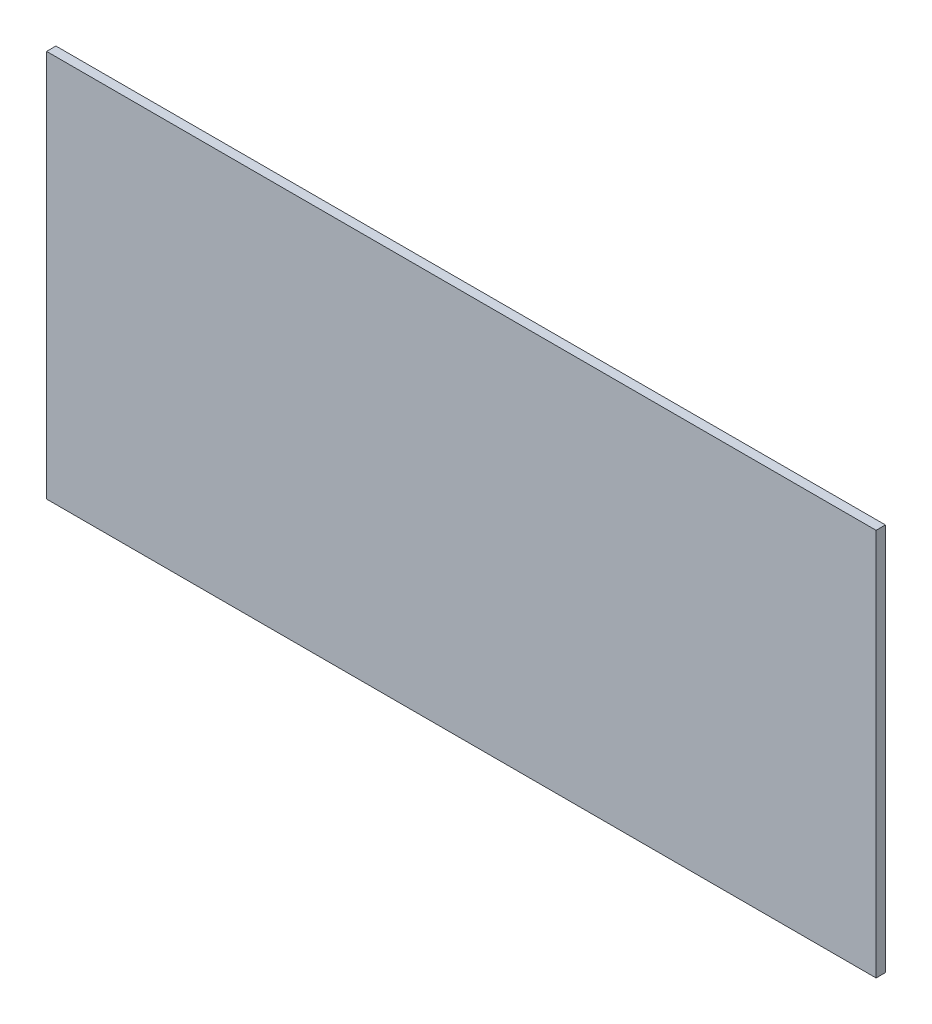
ISO-10303-21;
HEADER;
FILE_DESCRIPTION(('STEP AP214'),'2;1');
FILE_NAME('part.step','',(''),(''),'','','');
FILE_SCHEMA(('AUTOMOTIVE_DESIGN { 1 0 10303 214 1 1 1 1 }'));
ENDSEC;
DATA;
#1=APPLICATION_CONTEXT('core data for automotive mechanical design processes');
#2=APPLICATION_PROTOCOL_DEFINITION('international standard','automotive_design',2000,#1);
#3=PRODUCT_CONTEXT('',#1,'mechanical');
#4=PRODUCT('Part','Part','',(#3));
#5=PRODUCT_RELATED_PRODUCT_CATEGORY('part','',(#4));
#6=PRODUCT_DEFINITION_FORMATION('','',#4);
#7=PRODUCT_DEFINITION_CONTEXT('part definition',#1,'design');
#8=PRODUCT_DEFINITION('design','',#6,#7);
#9=PRODUCT_DEFINITION_SHAPE('','',#8);
#10=(LENGTH_UNIT() NAMED_UNIT(*) SI_UNIT(.MILLI.,.METRE.));
#11=(NAMED_UNIT(*) PLANE_ANGLE_UNIT() SI_UNIT($,.RADIAN.));
#12=(NAMED_UNIT(*) SI_UNIT($,.STERADIAN.) SOLID_ANGLE_UNIT());
#13=UNCERTAINTY_MEASURE_WITH_UNIT(LENGTH_MEASURE(1.E-05),#10,'distance_accuracy_value','');
#14=(GEOMETRIC_REPRESENTATION_CONTEXT(3) GLOBAL_UNCERTAINTY_ASSIGNED_CONTEXT((#13)) GLOBAL_UNIT_ASSIGNED_CONTEXT((#10,
#11,#12)) REPRESENTATION_CONTEXT('',''));
#15=CARTESIAN_POINT('',(0.,0.,0.));
#16=DIRECTION('',(0.,0.,1.));
#17=DIRECTION('',(1.,0.,0.));
#18=AXIS2_PLACEMENT_3D('',#15,#16,#17);
#19=CARTESIAN_POINT('',(41.8452050758157,181.663920133065,0.127000000000016));
#20=DIRECTION('',(-1.,0.,0.));
#21=DIRECTION('',(0.,-0.999999999999981,0.));
#22=AXIS2_PLACEMENT_3D('',#19,#20,#21);
#23=PLANE('',#22);
#24=DIRECTION('',(0.,0.999999999999981,0.));
#25=VECTOR('',#24,1.);
#26=CARTESIAN_POINT('',(41.8452050758158,181.663920133065,0.));
#27=LINE('',#26,#25);
#28=CARTESIAN_POINT('',(41.8452050758158,181.663920133065,0.));
#29=VERTEX_POINT('',#28);
#30=CARTESIAN_POINT('',(41.8452050758158,186.947120133065,0.));
#31=VERTEX_POINT('',#30);
#32=EDGE_CURVE('E97',#29,#31,#27,.T.);
#33=ORIENTED_EDGE('',*,*,#32,.T.);
#34=DIRECTION('',(0.,0.,-0.999999999999982));
#35=VECTOR('',#34,1.);
#36=CARTESIAN_POINT('',(41.8452050758157,186.947120133066,0.127000000000932));
#37=LINE('',#36,#35);
#38=CARTESIAN_POINT('',(41.8452050758157,186.947120133066,0.127000000000932));
#39=VERTEX_POINT('',#38);
#40=EDGE_CURVE('E11',#39,#31,#37,.T.);
#41=ORIENTED_EDGE('',*,*,#40,.F.);
#42=DIRECTION('',(0.,0.999999999999981,0.));
#43=VECTOR('',#42,1.);
#44=CARTESIAN_POINT('',(41.8452050758157,181.663920133065,0.127000000000016));
#45=LINE('',#44,#43);
#46=CARTESIAN_POINT('',(41.8452050758157,181.663920133065,0.127000000000016));
#47=VERTEX_POINT('',#46);
#48=EDGE_CURVE('E85',#47,#39,#45,.T.);
#49=ORIENTED_EDGE('',*,*,#48,.F.);
#50=DIRECTION('',(0.,0.,-0.999999999999982));
#51=VECTOR('',#50,1.);
#52=CARTESIAN_POINT('',(41.8452050758157,181.663920133065,0.127000000000016));
#53=LINE('',#52,#51);
#54=EDGE_CURVE('E93',#47,#29,#53,.T.);
#55=ORIENTED_EDGE('',*,*,#54,.T.);
#56=EDGE_LOOP('',(#33,#41,#49,#55));
#57=FACE_BOUND('',#56,.T.);
#58=ADVANCED_FACE('F34',(#57),#23,.F.);
#59=CARTESIAN_POINT('',(41.8452050758157,186.947120133066,0.127000000000932));
#60=DIRECTION('',(0.,-0.999999999999981,0.));
#61=DIRECTION('',(1.,0.,0.));
#62=AXIS2_PLACEMENT_3D('',#59,#60,#61);
#63=PLANE('',#62);
#64=DIRECTION('',(-1.,0.,0.));
#65=VECTOR('',#64,1.);
#66=CARTESIAN_POINT('',(41.8452050758158,186.947120133065,0.));
#67=LINE('',#66,#65);
#68=CARTESIAN_POINT('',(30.5422050758157,186.947120133065,-3.33934269125535E-13));
#69=VERTEX_POINT('',#68);
#70=EDGE_CURVE('E89',#31,#69,#67,.T.);
#71=ORIENTED_EDGE('',*,*,#70,.T.);
#72=DIRECTION('',(0.,0.,-0.999999999999982));
#73=VECTOR('',#72,1.);
#74=CARTESIAN_POINT('',(30.5422050758157,186.947120133066,0.127000000000626));
#75=LINE('',#74,#73);
#76=CARTESIAN_POINT('',(30.5422050758157,186.947120133066,0.127000000000626));
#77=VERTEX_POINT('',#76);
#78=EDGE_CURVE('E42',#77,#69,#75,.T.);
#79=ORIENTED_EDGE('',*,*,#78,.F.);
#80=DIRECTION('',(-1.,0.,0.));
#81=VECTOR('',#80,1.);
#82=CARTESIAN_POINT('',(41.8452050758157,186.947120133066,0.127000000000932));
#83=LINE('',#82,#81);
#84=EDGE_CURVE('E80',#39,#77,#83,.T.);
#85=ORIENTED_EDGE('',*,*,#84,.F.);
#86=ORIENTED_EDGE('',*,*,#40,.T.);
#87=EDGE_LOOP('',(#71,#79,#85,#86));
#88=FACE_BOUND('',#87,.T.);
#89=ADVANCED_FACE('F88',(#88),#63,.F.);
#90=CARTESIAN_POINT('',(30.5422050758157,186.947120133066,0.127000000000626));
#91=DIRECTION('',(1.,0.,0.));
#92=DIRECTION('',(0.,0.,-0.999999999999982));
#93=AXIS2_PLACEMENT_3D('',#90,#91,#92);
#94=PLANE('',#93);
#95=DIRECTION('',(0.,-0.999999999999981,0.));
#96=VECTOR('',#95,1.);
#97=CARTESIAN_POINT('',(30.5422050758157,186.947120133065,-3.33934269125535E-13));
#98=LINE('',#97,#96);
#99=CARTESIAN_POINT('',(30.5422050758158,181.663920133065,-5.28656979303932E-13));
#100=VERTEX_POINT('',#99);
#101=EDGE_CURVE('E67',#69,#100,#98,.T.);
#102=ORIENTED_EDGE('',*,*,#101,.T.);
#103=DIRECTION('',(0.,0.,-0.999999999999982));
#104=VECTOR('',#103,1.);
#105=CARTESIAN_POINT('',(30.5422050758159,181.663920133065,0.126999999999432));
#106=LINE('',#105,#104);
#107=CARTESIAN_POINT('',(30.5422050758159,181.663920133065,0.126999999999432));
#108=VERTEX_POINT('',#107);
#109=EDGE_CURVE('E90',#108,#100,#106,.T.);
#110=ORIENTED_EDGE('',*,*,#109,.F.);
#111=DIRECTION('',(0.,-0.999999999999981,0.));
#112=VECTOR('',#111,1.);
#113=CARTESIAN_POINT('',(30.5422050758157,186.947120133066,0.127000000000626));
#114=LINE('',#113,#112);
#115=EDGE_CURVE('E83',#77,#108,#114,.T.);
#116=ORIENTED_EDGE('',*,*,#115,.F.);
#117=ORIENTED_EDGE('',*,*,#78,.T.);
#118=EDGE_LOOP('',(#102,#110,#116,#117));
#119=FACE_BOUND('',#118,.T.);
#120=ADVANCED_FACE('F91',(#119),#94,.F.);
#121=CARTESIAN_POINT('',(30.5422050758159,181.663920133065,0.126999999999432));
#122=DIRECTION('',(0.,0.999999999999981,0.));
#123=DIRECTION('',(0.,0.,0.999999999999982));
#124=AXIS2_PLACEMENT_3D('',#121,#122,#123);
#125=PLANE('',#124);
#126=DIRECTION('',(1.,0.,0.));
#127=VECTOR('',#126,1.);
#128=CARTESIAN_POINT('',(30.5422050758158,181.663920133065,-5.28656979303932E-13));
#129=LINE('',#128,#127);
#130=EDGE_CURVE('E73',#100,#29,#129,.T.);
#131=ORIENTED_EDGE('',*,*,#130,.T.);
#132=ORIENTED_EDGE('',*,*,#54,.F.);
#133=DIRECTION('',(1.,0.,0.));
#134=VECTOR('',#133,1.);
#135=CARTESIAN_POINT('',(30.5422050758159,181.663920133065,0.126999999999432));
#136=LINE('',#135,#134);
#137=EDGE_CURVE('E50',#108,#47,#136,.T.);
#138=ORIENTED_EDGE('',*,*,#137,.F.);
#139=ORIENTED_EDGE('',*,*,#109,.T.);
#140=EDGE_LOOP('',(#131,#132,#138,#139));
#141=FACE_BOUND('',#140,.T.);
#142=ADVANCED_FACE('F104',(#141),#125,.F.);
#143=CARTESIAN_POINT('',(0.,0.,0.127000000000016));
#144=DIRECTION('',(0.,0.,0.999999999999982));
#145=DIRECTION('',(1.,0.,0.));
#146=AXIS2_PLACEMENT_3D('',#143,#144,#145);
#147=PLANE('',#146);
#148=ORIENTED_EDGE('',*,*,#48,.T.);
#149=ORIENTED_EDGE('',*,*,#84,.T.);
#150=ORIENTED_EDGE('',*,*,#115,.T.);
#151=ORIENTED_EDGE('',*,*,#137,.T.);
#152=EDGE_LOOP('',(#148,#149,#150,#151));
#153=FACE_BOUND('',#152,.T.);
#154=ADVANCED_FACE('F81',(#153),#147,.T.);
#155=CARTESIAN_POINT('',(0.,0.,0.));
#156=DIRECTION('',(0.,0.,0.999999999999982));
#157=DIRECTION('',(1.,0.,0.));
#158=AXIS2_PLACEMENT_3D('',#155,#156,#157);
#159=PLANE('',#158);
#160=ORIENTED_EDGE('',*,*,#32,.F.);
#161=ORIENTED_EDGE('',*,*,#130,.F.);
#162=ORIENTED_EDGE('',*,*,#101,.F.);
#163=ORIENTED_EDGE('',*,*,#70,.F.);
#164=EDGE_LOOP('',(#160,#161,#162,#163));
#165=FACE_BOUND('',#164,.T.);
#166=ADVANCED_FACE('F107',(#165),#159,.F.);
#167=CLOSED_SHELL('',(#58,#89,#120,#142,#154,#166));
#168=MANIFOLD_SOLID_BREP('B2',#167);
#169=ADVANCED_BREP_SHAPE_REPRESENTATION('',(#18,#168),#14);
#170=SHAPE_DEFINITION_REPRESENTATION(#9,#169);
ENDSEC;
END-ISO-10303-21;
